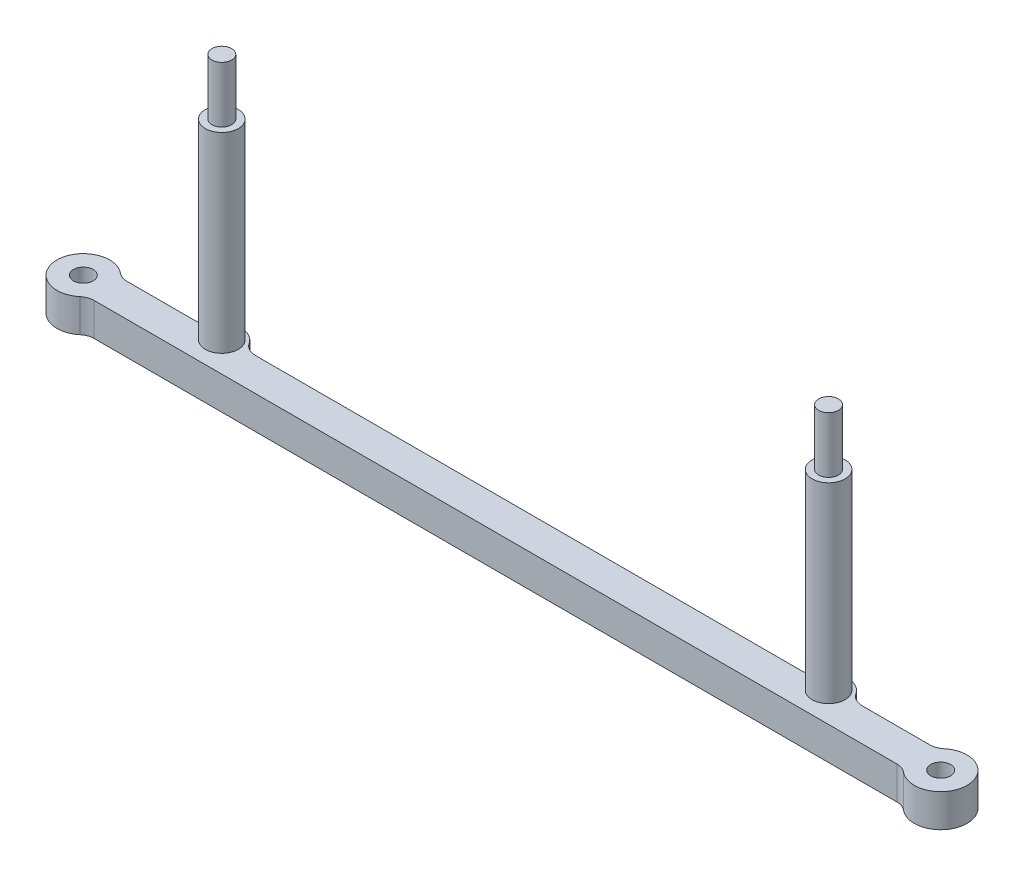
ISO-10303-21;
HEADER;
FILE_DESCRIPTION(('STEP AP214'),'2;1');
FILE_NAME('part.step','',(''),(''),'','','');
FILE_SCHEMA(('AUTOMOTIVE_DESIGN { 1 0 10303 214 1 1 1 1 }'));
ENDSEC;
DATA;
#1=APPLICATION_CONTEXT('core data for automotive mechanical design processes');
#2=APPLICATION_PROTOCOL_DEFINITION('international standard','automotive_design',2000,#1);
#3=PRODUCT_CONTEXT('',#1,'mechanical');
#4=PRODUCT('Part','Part','',(#3));
#5=PRODUCT_RELATED_PRODUCT_CATEGORY('part','',(#4));
#6=PRODUCT_DEFINITION_FORMATION('','',#4);
#7=PRODUCT_DEFINITION_CONTEXT('part definition',#1,'design');
#8=PRODUCT_DEFINITION('design','',#6,#7);
#9=PRODUCT_DEFINITION_SHAPE('','',#8);
#10=(LENGTH_UNIT() NAMED_UNIT(*) SI_UNIT(.MILLI.,.METRE.));
#11=(NAMED_UNIT(*) PLANE_ANGLE_UNIT() SI_UNIT($,.RADIAN.));
#12=(NAMED_UNIT(*) SI_UNIT($,.STERADIAN.) SOLID_ANGLE_UNIT());
#13=UNCERTAINTY_MEASURE_WITH_UNIT(LENGTH_MEASURE(1.E-05),#10,'distance_accuracy_value','');
#14=(GEOMETRIC_REPRESENTATION_CONTEXT(3) GLOBAL_UNCERTAINTY_ASSIGNED_CONTEXT((#13)) GLOBAL_UNIT_ASSIGNED_CONTEXT((#10,
#11,#12)) REPRESENTATION_CONTEXT('',''));
#15=CARTESIAN_POINT('',(0.,0.,0.));
#16=DIRECTION('',(0.,0.,1.));
#17=DIRECTION('',(1.,0.,0.));
#18=AXIS2_PLACEMENT_3D('',#15,#16,#17);
#19=CARTESIAN_POINT('',(46.,34.,-2.));
#20=DIRECTION('',(0.,1.,0.));
#21=DIRECTION('',(0.,0.,1.));
#22=AXIS2_PLACEMENT_3D('',#19,#20,#21);
#23=PLANE('',#22);
#24=CARTESIAN_POINT('',(46.,34.,-2.));
#25=DIRECTION('',(0.,1.,0.));
#26=DIRECTION('',(0.,0.,1.));
#27=AXIS2_PLACEMENT_3D('',#24,#25,#26);
#28=CIRCLE('',#27,2.5);
#29=CARTESIAN_POINT('',(46.,34.,0.500000000000002));
#30=VERTEX_POINT('',#29);
#31=EDGE_CURVE('E535',#30,#30,#28,.T.);
#32=ORIENTED_EDGE('',*,*,#31,.T.);
#33=EDGE_LOOP('',(#32));
#34=FACE_BOUND('',#33,.T.);
#35=CARTESIAN_POINT('',(46.,34.,-2.));
#36=DIRECTION('',(0.,1.,0.));
#37=DIRECTION('',(0.,0.,1.));
#38=AXIS2_PLACEMENT_3D('',#35,#36,#37);
#39=CIRCLE('',#38,1.5);
#40=CARTESIAN_POINT('',(46.,34.,-0.499999999999996));
#41=VERTEX_POINT('',#40);
#42=EDGE_CURVE('E524',#41,#41,#39,.T.);
#43=ORIENTED_EDGE('',*,*,#42,.F.);
#44=EDGE_LOOP('',(#43));
#45=FACE_BOUND('',#44,.T.);
#46=ADVANCED_FACE('F63',(#34,#45),#23,.T.);
#47=CARTESIAN_POINT('',(-46.,34.,-2.));
#48=DIRECTION('',(0.,1.,0.));
#49=DIRECTION('',(0.,0.,1.));
#50=AXIS2_PLACEMENT_3D('',#47,#48,#49);
#51=PLANE('',#50);
#52=CARTESIAN_POINT('',(-46.,34.,-2.));
#53=DIRECTION('',(0.,1.,0.));
#54=DIRECTION('',(0.,0.,1.));
#55=AXIS2_PLACEMENT_3D('',#52,#53,#54);
#56=CIRCLE('',#55,2.5);
#57=CARTESIAN_POINT('',(-46.,34.,0.500000000000002));
#58=VERTEX_POINT('',#57);
#59=EDGE_CURVE('E317',#58,#58,#56,.T.);
#60=ORIENTED_EDGE('',*,*,#59,.T.);
#61=EDGE_LOOP('',(#60));
#62=FACE_BOUND('',#61,.T.);
#63=CARTESIAN_POINT('',(-46.,34.,-2.));
#64=DIRECTION('',(0.,1.,0.));
#65=DIRECTION('',(0.,0.,1.));
#66=AXIS2_PLACEMENT_3D('',#63,#64,#65);
#67=CIRCLE('',#66,1.5);
#68=CARTESIAN_POINT('',(-46.,34.,-0.499999999999996));
#69=VERTEX_POINT('',#68);
#70=EDGE_CURVE('E523',#69,#69,#67,.T.);
#71=ORIENTED_EDGE('',*,*,#70,.F.);
#72=EDGE_LOOP('',(#71));
#73=FACE_BOUND('',#72,.T.);
#74=ADVANCED_FACE('F366',(#62,#73),#51,.T.);
#75=CARTESIAN_POINT('',(0.,5.,0.));
#76=DIRECTION('',(0.,1.,0.));
#77=DIRECTION('',(0.,0.,1.));
#78=AXIS2_PLACEMENT_3D('',#75,#76,#77);
#79=PLANE('',#78);
#80=CARTESIAN_POINT('',(-46.,5.,-2.));
#81=DIRECTION('',(0.,1.,0.));
#82=DIRECTION('',(0.,0.,1.));
#83=AXIS2_PLACEMENT_3D('',#80,#81,#82);
#84=CIRCLE('',#83,2.5);
#85=CARTESIAN_POINT('',(-46.,5.,0.500000000000002));
#86=VERTEX_POINT('',#85);
#87=EDGE_CURVE('E537',#86,#86,#84,.T.);
#88=ORIENTED_EDGE('',*,*,#87,.F.);
#89=EDGE_LOOP('',(#88));
#90=FACE_BOUND('',#89,.T.);
#91=DIRECTION('',(1.,0.,0.));
#92=VECTOR('',#91,1.);
#93=CARTESIAN_POINT('',(0.,5.,-2.5));
#94=LINE('',#93,#92);
#95=CARTESIAN_POINT('',(-41.3902277713536,5.,-2.5));
#96=VERTEX_POINT('',#95);
#97=CARTESIAN_POINT('',(41.3902277713536,5.,-2.5));
#98=VERTEX_POINT('',#97);
#99=EDGE_CURVE('E331',#96,#98,#94,.T.);
#100=ORIENTED_EDGE('',*,*,#99,.F.);
#101=CARTESIAN_POINT('',(-41.3902277713536,5.,-5.));
#102=DIRECTION('',(0.,1.,0.));
#103=DIRECTION('',(0.,0.,1.));
#104=AXIS2_PLACEMENT_3D('',#101,#102,#103);
#105=CIRCLE('',#104,2.5);
#106=CARTESIAN_POINT('',(-43.4855787843747,5.,-3.63636363636364));
#107=VERTEX_POINT('',#106);
#108=EDGE_CURVE('E187',#96,#107,#105,.F.);
#109=ORIENTED_EDGE('',*,*,#108,.T.);
#110=CARTESIAN_POINT('',(-46.,5.,-2.));
#111=DIRECTION('',(0.,1.,0.));
#112=DIRECTION('',(0.,0.,1.));
#113=AXIS2_PLACEMENT_3D('',#110,#111,#112);
#114=CIRCLE('',#113,3.);
#115=CARTESIAN_POINT('',(-48.5144212156253,5.,-3.63636363636364));
#116=VERTEX_POINT('',#115);
#117=EDGE_CURVE('E195',#107,#116,#114,.T.);
#118=ORIENTED_EDGE('',*,*,#117,.T.);
#119=CARTESIAN_POINT('',(-50.6097722286464,5.,-5.));
#120=DIRECTION('',(0.,1.,0.));
#121=DIRECTION('',(0.,0.,1.));
#122=AXIS2_PLACEMENT_3D('',#119,#120,#121);
#123=CIRCLE('',#122,2.5);
#124=CARTESIAN_POINT('',(-50.6097722286464,5.,-2.5));
#125=VERTEX_POINT('',#124);
#126=EDGE_CURVE('E78',#116,#125,#123,.F.);
#127=ORIENTED_EDGE('',*,*,#126,.T.);
#128=DIRECTION('',(1.,0.,0.));
#129=VECTOR('',#128,1.);
#130=CARTESIAN_POINT('',(0.,5.,-2.5));
#131=LINE('',#130,#129);
#132=CARTESIAN_POINT('',(-60.846688068541,5.,-2.5));
#133=VERTEX_POINT('',#132);
#134=EDGE_CURVE('E336',#133,#125,#131,.T.);
#135=ORIENTED_EDGE('',*,*,#134,.F.);
#136=CARTESIAN_POINT('',(-60.846688068541,5.,-5.));
#137=DIRECTION('',(0.,1.,0.));
#138=DIRECTION('',(0.,0.,1.));
#139=AXIS2_PLACEMENT_3D('',#136,#137,#138);
#140=CIRCLE('',#139,2.5);
#141=CARTESIAN_POINT('',(-62.4441157344867,5.,-3.07692307692308));
#142=VERTEX_POINT('',#141);
#143=EDGE_CURVE('E280',#133,#142,#140,.F.);
#144=ORIENTED_EDGE('',*,*,#143,.T.);
#145=CARTESIAN_POINT('',(-65.,5.,0.));
#146=DIRECTION('',(0.,1.,0.));
#147=DIRECTION('',(0.,0.,1.));
#148=AXIS2_PLACEMENT_3D('',#145,#146,#147);
#149=CIRCLE('',#148,4.00000000000001);
#150=CARTESIAN_POINT('',(-62.4441157344868,5.,3.07692307692309));
#151=VERTEX_POINT('',#150);
#152=EDGE_CURVE('E309',#142,#151,#149,.T.);
#153=ORIENTED_EDGE('',*,*,#152,.T.);
#154=CARTESIAN_POINT('',(-60.846688068541,5.,5.00000000000002));
#155=DIRECTION('',(0.,1.,0.));
#156=DIRECTION('',(0.,0.,1.));
#157=AXIS2_PLACEMENT_3D('',#154,#155,#156);
#158=CIRCLE('',#157,2.5);
#159=CARTESIAN_POINT('',(-60.846688068541,5.,2.50000000000002));
#160=VERTEX_POINT('',#159);
#161=EDGE_CURVE('E276',#151,#160,#158,.F.);
#162=ORIENTED_EDGE('',*,*,#161,.T.);
#163=DIRECTION('',(-1.,0.,0.));
#164=VECTOR('',#163,1.);
#165=CARTESIAN_POINT('',(0.,5.,2.50000000000002));
#166=LINE('',#165,#164);
#167=CARTESIAN_POINT('',(60.846688068541,5.,2.50000000000002));
#168=VERTEX_POINT('',#167);
#169=EDGE_CURVE('E301',#168,#160,#166,.T.);
#170=ORIENTED_EDGE('',*,*,#169,.F.);
#171=CARTESIAN_POINT('',(60.846688068541,5.,5.00000000000002));
#172=DIRECTION('',(0.,1.,0.));
#173=DIRECTION('',(0.,0.,1.));
#174=AXIS2_PLACEMENT_3D('',#171,#172,#173);
#175=CIRCLE('',#174,2.5);
#176=CARTESIAN_POINT('',(62.4441157344868,5.,3.07692307692309));
#177=VERTEX_POINT('',#176);
#178=EDGE_CURVE('E12',#168,#177,#175,.F.);
#179=ORIENTED_EDGE('',*,*,#178,.T.);
#180=CARTESIAN_POINT('',(65.,5.,0.));
#181=DIRECTION('',(0.,1.,0.));
#182=DIRECTION('',(0.,0.,1.));
#183=AXIS2_PLACEMENT_3D('',#180,#181,#182);
#184=CIRCLE('',#183,4.00000000000001);
#185=CARTESIAN_POINT('',(62.4441157344867,5.,-3.07692307692308));
#186=VERTEX_POINT('',#185);
#187=EDGE_CURVE('E299',#177,#186,#184,.T.);
#188=ORIENTED_EDGE('',*,*,#187,.T.);
#189=CARTESIAN_POINT('',(60.846688068541,5.,-5.));
#190=DIRECTION('',(0.,1.,0.));
#191=DIRECTION('',(0.,0.,1.));
#192=AXIS2_PLACEMENT_3D('',#189,#190,#191);
#193=CIRCLE('',#192,2.5);
#194=CARTESIAN_POINT('',(60.846688068541,5.,-2.5));
#195=VERTEX_POINT('',#194);
#196=EDGE_CURVE('E272',#186,#195,#193,.F.);
#197=ORIENTED_EDGE('',*,*,#196,.T.);
#198=DIRECTION('',(1.,0.,0.));
#199=VECTOR('',#198,1.);
#200=CARTESIAN_POINT('',(0.,5.,-2.5));
#201=LINE('',#200,#199);
#202=CARTESIAN_POINT('',(50.6097722286464,5.,-2.5));
#203=VERTEX_POINT('',#202);
#204=EDGE_CURVE('E226',#203,#195,#201,.T.);
#205=ORIENTED_EDGE('',*,*,#204,.F.);
#206=CARTESIAN_POINT('',(50.6097722286464,5.,-5.));
#207=DIRECTION('',(0.,1.,0.));
#208=DIRECTION('',(0.,0.,1.));
#209=AXIS2_PLACEMENT_3D('',#206,#207,#208);
#210=CIRCLE('',#209,2.5);
#211=CARTESIAN_POINT('',(48.5144212156253,5.,-3.63636363636364));
#212=VERTEX_POINT('',#211);
#213=EDGE_CURVE('E268',#203,#212,#210,.F.);
#214=ORIENTED_EDGE('',*,*,#213,.T.);
#215=CARTESIAN_POINT('',(46.,5.,-2.));
#216=DIRECTION('',(0.,1.,0.));
#217=DIRECTION('',(0.,0.,1.));
#218=AXIS2_PLACEMENT_3D('',#215,#216,#217);
#219=CIRCLE('',#218,3.);
#220=CARTESIAN_POINT('',(43.4855787843747,5.,-3.63636363636364));
#221=VERTEX_POINT('',#220);
#222=EDGE_CURVE('E332',#212,#221,#219,.T.);
#223=ORIENTED_EDGE('',*,*,#222,.T.);
#224=CARTESIAN_POINT('',(41.3902277713536,5.,-5.));
#225=DIRECTION('',(0.,1.,0.));
#226=DIRECTION('',(0.,0.,1.));
#227=AXIS2_PLACEMENT_3D('',#224,#225,#226);
#228=CIRCLE('',#227,2.5);
#229=EDGE_CURVE('E264',#221,#98,#228,.F.);
#230=ORIENTED_EDGE('',*,*,#229,.T.);
#231=EDGE_LOOP('',(#100,#109,#118,#127,#135,#144,#153,#162,#170,#179,#188,#197,#205,#214,#223,#230));
#232=FACE_BOUND('',#231,.T.);
#233=CARTESIAN_POINT('',(65.,5.,0.));
#234=DIRECTION('',(0.,1.,0.));
#235=DIRECTION('',(0.,0.,1.));
#236=AXIS2_PLACEMENT_3D('',#233,#234,#235);
#237=CIRCLE('',#236,1.5);
#238=CARTESIAN_POINT('',(65.,5.,1.5));
#239=VERTEX_POINT('',#238);
#240=EDGE_CURVE('E227',#239,#239,#237,.T.);
#241=ORIENTED_EDGE('',*,*,#240,.F.);
#242=EDGE_LOOP('',(#241));
#243=FACE_BOUND('',#242,.T.);
#244=CARTESIAN_POINT('',(-65.,5.,0.));
#245=DIRECTION('',(0.,1.,0.));
#246=DIRECTION('',(0.,0.,1.));
#247=AXIS2_PLACEMENT_3D('',#244,#245,#246);
#248=CIRCLE('',#247,1.5);
#249=CARTESIAN_POINT('',(-65.,5.,1.5));
#250=VERTEX_POINT('',#249);
#251=EDGE_CURVE('E305',#250,#250,#248,.T.);
#252=ORIENTED_EDGE('',*,*,#251,.F.);
#253=EDGE_LOOP('',(#252));
#254=FACE_BOUND('',#253,.T.);
#255=CARTESIAN_POINT('',(46.,5.,-2.));
#256=DIRECTION('',(0.,1.,0.));
#257=DIRECTION('',(0.,0.,1.));
#258=AXIS2_PLACEMENT_3D('',#255,#256,#257);
#259=CIRCLE('',#258,2.5);
#260=CARTESIAN_POINT('',(46.,5.,0.500000000000002));
#261=VERTEX_POINT('',#260);
#262=EDGE_CURVE('E533',#261,#261,#259,.T.);
#263=ORIENTED_EDGE('',*,*,#262,.F.);
#264=EDGE_LOOP('',(#263));
#265=FACE_BOUND('',#264,.T.);
#266=ADVANCED_FACE('F297',(#90,#232,#243,#254,#265),#79,.T.);
#267=CARTESIAN_POINT('',(0.,0.,0.));
#268=DIRECTION('',(0.,1.,0.));
#269=DIRECTION('',(0.,0.,1.));
#270=AXIS2_PLACEMENT_3D('',#267,#268,#269);
#271=PLANE('',#270);
#272=CARTESIAN_POINT('',(-46.,0.,-2.));
#273=DIRECTION('',(0.,1.,0.));
#274=DIRECTION('',(0.,0.,1.));
#275=AXIS2_PLACEMENT_3D('',#272,#273,#274);
#276=CIRCLE('',#275,3.);
#277=CARTESIAN_POINT('',(-43.4855787843747,0.,-3.63636363636364));
#278=VERTEX_POINT('',#277);
#279=CARTESIAN_POINT('',(-48.5144212156253,0.,-3.63636363636364));
#280=VERTEX_POINT('',#279);
#281=EDGE_CURVE('E193',#278,#280,#276,.T.);
#282=ORIENTED_EDGE('',*,*,#281,.F.);
#283=CARTESIAN_POINT('',(-41.3902277713536,0.,-5.));
#284=DIRECTION('',(0.,1.,0.));
#285=DIRECTION('',(0.,0.,1.));
#286=AXIS2_PLACEMENT_3D('',#283,#284,#285);
#287=CIRCLE('',#286,2.5);
#288=CARTESIAN_POINT('',(-41.3902277713536,0.,-2.5));
#289=VERTEX_POINT('',#288);
#290=EDGE_CURVE('E177',#278,#289,#287,.T.);
#291=ORIENTED_EDGE('',*,*,#290,.T.);
#292=DIRECTION('',(1.,0.,0.));
#293=VECTOR('',#292,1.);
#294=CARTESIAN_POINT('',(0.,0.,-2.5));
#295=LINE('',#294,#293);
#296=CARTESIAN_POINT('',(41.3902277713536,0.,-2.5));
#297=VERTEX_POINT('',#296);
#298=EDGE_CURVE('E204',#289,#297,#295,.T.);
#299=ORIENTED_EDGE('',*,*,#298,.T.);
#300=CARTESIAN_POINT('',(41.3902277713536,0.,-5.));
#301=DIRECTION('',(0.,1.,0.));
#302=DIRECTION('',(0.,0.,1.));
#303=AXIS2_PLACEMENT_3D('',#300,#301,#302);
#304=CIRCLE('',#303,2.5);
#305=CARTESIAN_POINT('',(43.4855787843747,0.,-3.63636363636364));
#306=VERTEX_POINT('',#305);
#307=EDGE_CURVE('E262',#297,#306,#304,.T.);
#308=ORIENTED_EDGE('',*,*,#307,.T.);
#309=CARTESIAN_POINT('',(46.,0.,-2.));
#310=DIRECTION('',(0.,1.,0.));
#311=DIRECTION('',(0.,0.,1.));
#312=AXIS2_PLACEMENT_3D('',#309,#310,#311);
#313=CIRCLE('',#312,3.);
#314=CARTESIAN_POINT('',(48.5144212156253,0.,-3.63636363636364));
#315=VERTEX_POINT('',#314);
#316=EDGE_CURVE('E208',#315,#306,#313,.T.);
#317=ORIENTED_EDGE('',*,*,#316,.F.);
#318=CARTESIAN_POINT('',(50.6097722286464,0.,-5.));
#319=DIRECTION('',(0.,1.,0.));
#320=DIRECTION('',(0.,0.,1.));
#321=AXIS2_PLACEMENT_3D('',#318,#319,#320);
#322=CIRCLE('',#321,2.5);
#323=CARTESIAN_POINT('',(50.6097722286464,0.,-2.5));
#324=VERTEX_POINT('',#323);
#325=EDGE_CURVE('E266',#315,#324,#322,.T.);
#326=ORIENTED_EDGE('',*,*,#325,.T.);
#327=DIRECTION('',(1.,0.,0.));
#328=VECTOR('',#327,1.);
#329=CARTESIAN_POINT('',(0.,0.,-2.5));
#330=LINE('',#329,#328);
#331=CARTESIAN_POINT('',(60.846688068541,0.,-2.5));
#332=VERTEX_POINT('',#331);
#333=EDGE_CURVE('E315',#324,#332,#330,.T.);
#334=ORIENTED_EDGE('',*,*,#333,.T.);
#335=CARTESIAN_POINT('',(60.846688068541,0.,-5.));
#336=DIRECTION('',(0.,1.,0.));
#337=DIRECTION('',(0.,0.,1.));
#338=AXIS2_PLACEMENT_3D('',#335,#336,#337);
#339=CIRCLE('',#338,2.5);
#340=CARTESIAN_POINT('',(62.4441157344867,0.,-3.07692307692308));
#341=VERTEX_POINT('',#340);
#342=EDGE_CURVE('E270',#332,#341,#339,.T.);
#343=ORIENTED_EDGE('',*,*,#342,.T.);
#344=CARTESIAN_POINT('',(65.,0.,0.));
#345=DIRECTION('',(0.,1.,0.));
#346=DIRECTION('',(0.,0.,1.));
#347=AXIS2_PLACEMENT_3D('',#344,#345,#346);
#348=CIRCLE('',#347,4.00000000000001);
#349=CARTESIAN_POINT('',(62.4441157344868,0.,3.07692307692309));
#350=VERTEX_POINT('',#349);
#351=EDGE_CURVE('E217',#350,#341,#348,.T.);
#352=ORIENTED_EDGE('',*,*,#351,.F.);
#353=CARTESIAN_POINT('',(60.846688068541,0.,5.00000000000002));
#354=DIRECTION('',(0.,1.,0.));
#355=DIRECTION('',(0.,0.,1.));
#356=AXIS2_PLACEMENT_3D('',#353,#354,#355);
#357=CIRCLE('',#356,2.5);
#358=CARTESIAN_POINT('',(60.846688068541,0.,2.50000000000002));
#359=VERTEX_POINT('',#358);
#360=EDGE_CURVE('E71',#350,#359,#357,.T.);
#361=ORIENTED_EDGE('',*,*,#360,.T.);
#362=DIRECTION('',(-1.,0.,0.));
#363=VECTOR('',#362,1.);
#364=CARTESIAN_POINT('',(0.,0.,2.50000000000002));
#365=LINE('',#364,#363);
#366=CARTESIAN_POINT('',(-60.846688068541,0.,2.50000000000002));
#367=VERTEX_POINT('',#366);
#368=EDGE_CURVE('E214',#359,#367,#365,.T.);
#369=ORIENTED_EDGE('',*,*,#368,.T.);
#370=CARTESIAN_POINT('',(-60.846688068541,0.,5.00000000000002));
#371=DIRECTION('',(0.,1.,0.));
#372=DIRECTION('',(0.,0.,1.));
#373=AXIS2_PLACEMENT_3D('',#370,#371,#372);
#374=CIRCLE('',#373,2.5);
#375=CARTESIAN_POINT('',(-62.4441157344868,0.,3.07692307692309));
#376=VERTEX_POINT('',#375);
#377=EDGE_CURVE('E274',#367,#376,#374,.T.);
#378=ORIENTED_EDGE('',*,*,#377,.T.);
#379=CARTESIAN_POINT('',(-65.,0.,0.));
#380=DIRECTION('',(0.,1.,0.));
#381=DIRECTION('',(0.,0.,1.));
#382=AXIS2_PLACEMENT_3D('',#379,#380,#381);
#383=CIRCLE('',#382,4.00000000000001);
#384=CARTESIAN_POINT('',(-62.4441157344867,0.,-3.07692307692308));
#385=VERTEX_POINT('',#384);
#386=EDGE_CURVE('E206',#385,#376,#383,.T.);
#387=ORIENTED_EDGE('',*,*,#386,.F.);
#388=CARTESIAN_POINT('',(-60.846688068541,0.,-5.));
#389=DIRECTION('',(0.,1.,0.));
#390=DIRECTION('',(0.,0.,1.));
#391=AXIS2_PLACEMENT_3D('',#388,#389,#390);
#392=CIRCLE('',#391,2.5);
#393=CARTESIAN_POINT('',(-60.846688068541,0.,-2.5));
#394=VERTEX_POINT('',#393);
#395=EDGE_CURVE('E278',#385,#394,#392,.T.);
#396=ORIENTED_EDGE('',*,*,#395,.T.);
#397=DIRECTION('',(1.,0.,0.));
#398=VECTOR('',#397,1.);
#399=CARTESIAN_POINT('',(0.,0.,-2.5));
#400=LINE('',#399,#398);
#401=CARTESIAN_POINT('',(-50.6097722286464,0.,-2.5));
#402=VERTEX_POINT('',#401);
#403=EDGE_CURVE('E203',#394,#402,#400,.T.);
#404=ORIENTED_EDGE('',*,*,#403,.T.);
#405=CARTESIAN_POINT('',(-50.6097722286464,0.,-5.));
#406=DIRECTION('',(0.,1.,0.));
#407=DIRECTION('',(0.,0.,1.));
#408=AXIS2_PLACEMENT_3D('',#405,#406,#407);
#409=CIRCLE('',#408,2.5);
#410=EDGE_CURVE('E202',#402,#280,#409,.T.);
#411=ORIENTED_EDGE('',*,*,#410,.T.);
#412=EDGE_LOOP('',(#282,#291,#299,#308,#317,#326,#334,#343,#352,#361,#369,#378,#387,#396,#404,#411));
#413=FACE_BOUND('',#412,.T.);
#414=CARTESIAN_POINT('',(65.,0.,0.));
#415=DIRECTION('',(0.,1.,0.));
#416=DIRECTION('',(0.,0.,1.));
#417=AXIS2_PLACEMENT_3D('',#414,#415,#416);
#418=CIRCLE('',#417,1.5);
#419=CARTESIAN_POINT('',(65.,0.,1.5));
#420=VERTEX_POINT('',#419);
#421=EDGE_CURVE('E223',#420,#420,#418,.T.);
#422=ORIENTED_EDGE('',*,*,#421,.T.);
#423=EDGE_LOOP('',(#422));
#424=FACE_BOUND('',#423,.T.);
#425=CARTESIAN_POINT('',(-65.,0.,0.));
#426=DIRECTION('',(0.,1.,0.));
#427=DIRECTION('',(0.,0.,1.));
#428=AXIS2_PLACEMENT_3D('',#425,#426,#427);
#429=CIRCLE('',#428,1.5);
#430=CARTESIAN_POINT('',(-65.,0.,1.5));
#431=VERTEX_POINT('',#430);
#432=EDGE_CURVE('E220',#431,#431,#429,.T.);
#433=ORIENTED_EDGE('',*,*,#432,.T.);
#434=EDGE_LOOP('',(#433));
#435=FACE_BOUND('',#434,.T.);
#436=ADVANCED_FACE('F199',(#413,#424,#435),#271,.F.);
#437=CARTESIAN_POINT('',(-46.,5.,-2.));
#438=DIRECTION('',(0.,-1.,0.));
#439=DIRECTION('',(0.,0.,-1.));
#440=AXIS2_PLACEMENT_3D('',#437,#438,#439);
#441=CYLINDRICAL_SURFACE('',#440,3.);
#442=ORIENTED_EDGE('',*,*,#117,.F.);
#443=DIRECTION('',(0.,-1.,0.));
#444=VECTOR('',#443,1.);
#445=CARTESIAN_POINT('',(-43.4855787843747,5.,-3.63636363636364));
#446=LINE('',#445,#444);
#447=EDGE_CURVE('E181',#107,#278,#446,.T.);
#448=ORIENTED_EDGE('',*,*,#447,.T.);
#449=ORIENTED_EDGE('',*,*,#281,.T.);
#450=DIRECTION('',(0.,-1.,0.));
#451=VECTOR('',#450,1.);
#452=CARTESIAN_POINT('',(-48.5144212156253,5.,-3.63636363636364));
#453=LINE('',#452,#451);
#454=EDGE_CURVE('E197',#280,#116,#453,.F.);
#455=ORIENTED_EDGE('',*,*,#454,.T.);
#456=EDGE_LOOP('',(#442,#448,#449,#455));
#457=FACE_BOUND('',#456,.T.);
#458=ADVANCED_FACE('F192',(#457),#441,.T.);
#459=CARTESIAN_POINT('',(0.,5.,-2.5));
#460=DIRECTION('',(0.,0.,-1.));
#461=DIRECTION('',(-1.,0.,0.));
#462=AXIS2_PLACEMENT_3D('',#459,#460,#461);
#463=PLANE('',#462);
#464=ORIENTED_EDGE('',*,*,#403,.F.);
#465=DIRECTION('',(0.,-1.,0.));
#466=VECTOR('',#465,1.);
#467=CARTESIAN_POINT('',(-60.846688068541,5.,-2.5));
#468=LINE('',#467,#466);
#469=EDGE_CURVE('E85',#394,#133,#468,.F.);
#470=ORIENTED_EDGE('',*,*,#469,.T.);
#471=ORIENTED_EDGE('',*,*,#134,.T.);
#472=DIRECTION('',(0.,-1.,0.));
#473=VECTOR('',#472,1.);
#474=CARTESIAN_POINT('',(-50.6097722286464,5.,-2.5));
#475=LINE('',#474,#473);
#476=EDGE_CURVE('E257',#125,#402,#475,.T.);
#477=ORIENTED_EDGE('',*,*,#476,.T.);
#478=EDGE_LOOP('',(#464,#470,#471,#477));
#479=FACE_BOUND('',#478,.T.);
#480=ADVANCED_FACE('F354',(#479),#463,.T.);
#481=CARTESIAN_POINT('',(-65.,5.,0.));
#482=DIRECTION('',(0.,-1.,0.));
#483=DIRECTION('',(0.,0.,-1.));
#484=AXIS2_PLACEMENT_3D('',#481,#482,#483);
#485=CYLINDRICAL_SURFACE('',#484,4.00000000000001);
#486=ORIENTED_EDGE('',*,*,#386,.T.);
#487=DIRECTION('',(0.,-1.,0.));
#488=VECTOR('',#487,1.);
#489=CARTESIAN_POINT('',(-62.4441157344868,5.,3.07692307692309));
#490=LINE('',#489,#488);
#491=EDGE_CURVE('E255',#376,#151,#490,.F.);
#492=ORIENTED_EDGE('',*,*,#491,.T.);
#493=ORIENTED_EDGE('',*,*,#152,.F.);
#494=DIRECTION('',(0.,-1.,0.));
#495=VECTOR('',#494,1.);
#496=CARTESIAN_POINT('',(-62.4441157344867,5.,-3.07692307692308));
#497=LINE('',#496,#495);
#498=EDGE_CURVE('E252',#142,#385,#497,.T.);
#499=ORIENTED_EDGE('',*,*,#498,.T.);
#500=EDGE_LOOP('',(#486,#492,#493,#499));
#501=FACE_BOUND('',#500,.T.);
#502=ADVANCED_FACE('F351',(#501),#485,.T.);
#503=CARTESIAN_POINT('',(0.,5.,2.50000000000002));
#504=DIRECTION('',(0.,0.,1.));
#505=DIRECTION('',(1.,0.,0.));
#506=AXIS2_PLACEMENT_3D('',#503,#504,#505);
#507=PLANE('',#506);
#508=ORIENTED_EDGE('',*,*,#169,.T.);
#509=DIRECTION('',(0.,-1.,0.));
#510=VECTOR('',#509,1.);
#511=CARTESIAN_POINT('',(-60.846688068541,5.,2.50000000000002));
#512=LINE('',#511,#510);
#513=EDGE_CURVE('E249',#160,#367,#512,.T.);
#514=ORIENTED_EDGE('',*,*,#513,.T.);
#515=ORIENTED_EDGE('',*,*,#368,.F.);
#516=DIRECTION('',(0.,-1.,0.));
#517=VECTOR('',#516,1.);
#518=CARTESIAN_POINT('',(60.846688068541,5.,2.50000000000002));
#519=LINE('',#518,#517);
#520=EDGE_CURVE('E247',#359,#168,#519,.F.);
#521=ORIENTED_EDGE('',*,*,#520,.T.);
#522=EDGE_LOOP('',(#508,#514,#515,#521));
#523=FACE_BOUND('',#522,.T.);
#524=ADVANCED_FACE('F290',(#523),#507,.T.);
#525=CARTESIAN_POINT('',(65.,5.,0.));
#526=DIRECTION('',(0.,-1.,0.));
#527=DIRECTION('',(0.,0.,-1.));
#528=AXIS2_PLACEMENT_3D('',#525,#526,#527);
#529=CYLINDRICAL_SURFACE('',#528,4.00000000000001);
#530=ORIENTED_EDGE('',*,*,#351,.T.);
#531=DIRECTION('',(0.,-1.,0.));
#532=VECTOR('',#531,1.);
#533=CARTESIAN_POINT('',(62.4441157344867,5.,-3.07692307692308));
#534=LINE('',#533,#532);
#535=EDGE_CURVE('E245',#341,#186,#534,.F.);
#536=ORIENTED_EDGE('',*,*,#535,.T.);
#537=ORIENTED_EDGE('',*,*,#187,.F.);
#538=DIRECTION('',(0.,-1.,0.));
#539=VECTOR('',#538,1.);
#540=CARTESIAN_POINT('',(62.4441157344868,5.,3.07692307692309));
#541=LINE('',#540,#539);
#542=EDGE_CURVE('E242',#177,#350,#541,.T.);
#543=ORIENTED_EDGE('',*,*,#542,.T.);
#544=EDGE_LOOP('',(#530,#536,#537,#543));
#545=FACE_BOUND('',#544,.T.);
#546=ADVANCED_FACE('F303',(#545),#529,.T.);
#547=CARTESIAN_POINT('',(0.,5.,-2.5));
#548=DIRECTION('',(0.,0.,-1.));
#549=DIRECTION('',(-1.,0.,0.));
#550=AXIS2_PLACEMENT_3D('',#547,#548,#549);
#551=PLANE('',#550);
#552=ORIENTED_EDGE('',*,*,#333,.F.);
#553=DIRECTION('',(0.,-1.,0.));
#554=VECTOR('',#553,1.);
#555=CARTESIAN_POINT('',(50.6097722286464,5.,-2.5));
#556=LINE('',#555,#554);
#557=EDGE_CURVE('E240',#324,#203,#556,.F.);
#558=ORIENTED_EDGE('',*,*,#557,.T.);
#559=ORIENTED_EDGE('',*,*,#204,.T.);
#560=DIRECTION('',(0.,-1.,0.));
#561=VECTOR('',#560,1.);
#562=CARTESIAN_POINT('',(60.846688068541,5.,-2.5));
#563=LINE('',#562,#561);
#564=EDGE_CURVE('E237',#195,#332,#563,.T.);
#565=ORIENTED_EDGE('',*,*,#564,.T.);
#566=EDGE_LOOP('',(#552,#558,#559,#565));
#567=FACE_BOUND('',#566,.T.);
#568=ADVANCED_FACE('F402',(#567),#551,.T.);
#569=CARTESIAN_POINT('',(46.,5.,-2.));
#570=DIRECTION('',(0.,-1.,0.));
#571=DIRECTION('',(0.,0.,-1.));
#572=AXIS2_PLACEMENT_3D('',#569,#570,#571);
#573=CYLINDRICAL_SURFACE('',#572,3.);
#574=ORIENTED_EDGE('',*,*,#316,.T.);
#575=DIRECTION('',(0.,-1.,0.));
#576=VECTOR('',#575,1.);
#577=CARTESIAN_POINT('',(43.4855787843747,5.,-3.63636363636364));
#578=LINE('',#577,#576);
#579=EDGE_CURVE('E235',#306,#221,#578,.F.);
#580=ORIENTED_EDGE('',*,*,#579,.T.);
#581=ORIENTED_EDGE('',*,*,#222,.F.);
#582=DIRECTION('',(0.,-1.,0.));
#583=VECTOR('',#582,1.);
#584=CARTESIAN_POINT('',(48.5144212156253,5.,-3.63636363636364));
#585=LINE('',#584,#583);
#586=EDGE_CURVE('E232',#212,#315,#585,.T.);
#587=ORIENTED_EDGE('',*,*,#586,.T.);
#588=EDGE_LOOP('',(#574,#580,#581,#587));
#589=FACE_BOUND('',#588,.T.);
#590=ADVANCED_FACE('F322',(#589),#573,.T.);
#591=CARTESIAN_POINT('',(0.,5.,-2.5));
#592=DIRECTION('',(0.,0.,-1.));
#593=DIRECTION('',(-1.,0.,0.));
#594=AXIS2_PLACEMENT_3D('',#591,#592,#593);
#595=PLANE('',#594);
#596=ORIENTED_EDGE('',*,*,#298,.F.);
#597=DIRECTION('',(0.,-1.,0.));
#598=VECTOR('',#597,1.);
#599=CARTESIAN_POINT('',(-41.3902277713536,5.,-2.5));
#600=LINE('',#599,#598);
#601=EDGE_CURVE('E182',#289,#96,#600,.F.);
#602=ORIENTED_EDGE('',*,*,#601,.T.);
#603=ORIENTED_EDGE('',*,*,#99,.T.);
#604=DIRECTION('',(0.,-1.,0.));
#605=VECTOR('',#604,1.);
#606=CARTESIAN_POINT('',(41.3902277713536,5.,-2.5));
#607=LINE('',#606,#605);
#608=EDGE_CURVE('E196',#98,#297,#607,.T.);
#609=ORIENTED_EDGE('',*,*,#608,.T.);
#610=EDGE_LOOP('',(#596,#602,#603,#609));
#611=FACE_BOUND('',#610,.T.);
#612=ADVANCED_FACE('F334',(#611),#595,.T.);
#613=CARTESIAN_POINT('',(-65.,5.,0.));
#614=DIRECTION('',(0.,-1.,0.));
#615=DIRECTION('',(0.,0.,-1.));
#616=AXIS2_PLACEMENT_3D('',#613,#614,#615);
#617=CYLINDRICAL_SURFACE('',#616,1.5);
#618=ORIENTED_EDGE('',*,*,#251,.T.);
#619=EDGE_LOOP('',(#618));
#620=FACE_BOUND('',#619,.T.);
#621=ORIENTED_EDGE('',*,*,#432,.F.);
#622=EDGE_LOOP('',(#621));
#623=FACE_BOUND('',#622,.T.);
#624=ADVANCED_FACE('F395',(#620,#623),#617,.F.);
#625=CARTESIAN_POINT('',(65.,5.,0.));
#626=DIRECTION('',(0.,-1.,0.));
#627=DIRECTION('',(0.,0.,-1.));
#628=AXIS2_PLACEMENT_3D('',#625,#626,#627);
#629=CYLINDRICAL_SURFACE('',#628,1.5);
#630=ORIENTED_EDGE('',*,*,#240,.T.);
#631=EDGE_LOOP('',(#630));
#632=FACE_BOUND('',#631,.T.);
#633=ORIENTED_EDGE('',*,*,#421,.F.);
#634=EDGE_LOOP('',(#633));
#635=FACE_BOUND('',#634,.T.);
#636=ADVANCED_FACE('F392',(#632,#635),#629,.F.);
#637=CARTESIAN_POINT('',(-41.3902277713536,5.,-5.));
#638=DIRECTION('',(0.,-1.,0.));
#639=DIRECTION('',(0.,0.,-1.));
#640=AXIS2_PLACEMENT_3D('',#637,#638,#639);
#641=CYLINDRICAL_SURFACE('',#640,2.5);
#642=ORIENTED_EDGE('',*,*,#108,.F.);
#643=ORIENTED_EDGE('',*,*,#601,.F.);
#644=ORIENTED_EDGE('',*,*,#290,.F.);
#645=ORIENTED_EDGE('',*,*,#447,.F.);
#646=EDGE_LOOP('',(#642,#643,#644,#645));
#647=FACE_BOUND('',#646,.T.);
#648=ADVANCED_FACE('F180',(#647),#641,.F.);
#649=CARTESIAN_POINT('',(41.3902277713536,5.,-5.));
#650=DIRECTION('',(0.,-1.,0.));
#651=DIRECTION('',(0.,0.,-1.));
#652=AXIS2_PLACEMENT_3D('',#649,#650,#651);
#653=CYLINDRICAL_SURFACE('',#652,2.5);
#654=ORIENTED_EDGE('',*,*,#229,.F.);
#655=ORIENTED_EDGE('',*,*,#579,.F.);
#656=ORIENTED_EDGE('',*,*,#307,.F.);
#657=ORIENTED_EDGE('',*,*,#608,.F.);
#658=EDGE_LOOP('',(#654,#655,#656,#657));
#659=FACE_BOUND('',#658,.T.);
#660=ADVANCED_FACE('F328',(#659),#653,.F.);
#661=CARTESIAN_POINT('',(50.6097722286464,5.,-5.));
#662=DIRECTION('',(0.,-1.,0.));
#663=DIRECTION('',(0.,0.,-1.));
#664=AXIS2_PLACEMENT_3D('',#661,#662,#663);
#665=CYLINDRICAL_SURFACE('',#664,2.5);
#666=ORIENTED_EDGE('',*,*,#213,.F.);
#667=ORIENTED_EDGE('',*,*,#557,.F.);
#668=ORIENTED_EDGE('',*,*,#325,.F.);
#669=ORIENTED_EDGE('',*,*,#586,.F.);
#670=EDGE_LOOP('',(#666,#667,#668,#669));
#671=FACE_BOUND('',#670,.T.);
#672=ADVANCED_FACE('F422',(#671),#665,.F.);
#673=CARTESIAN_POINT('',(60.846688068541,5.,-5.));
#674=DIRECTION('',(0.,-1.,0.));
#675=DIRECTION('',(0.,0.,-1.));
#676=AXIS2_PLACEMENT_3D('',#673,#674,#675);
#677=CYLINDRICAL_SURFACE('',#676,2.5);
#678=ORIENTED_EDGE('',*,*,#196,.F.);
#679=ORIENTED_EDGE('',*,*,#535,.F.);
#680=ORIENTED_EDGE('',*,*,#342,.F.);
#681=ORIENTED_EDGE('',*,*,#564,.F.);
#682=EDGE_LOOP('',(#678,#679,#680,#681));
#683=FACE_BOUND('',#682,.T.);
#684=ADVANCED_FACE('F425',(#683),#677,.F.);
#685=CARTESIAN_POINT('',(-60.846688068541,5.,5.00000000000002));
#686=DIRECTION('',(0.,-1.,0.));
#687=DIRECTION('',(0.,0.,-1.));
#688=AXIS2_PLACEMENT_3D('',#685,#686,#687);
#689=CYLINDRICAL_SURFACE('',#688,2.5);
#690=ORIENTED_EDGE('',*,*,#161,.F.);
#691=ORIENTED_EDGE('',*,*,#491,.F.);
#692=ORIENTED_EDGE('',*,*,#377,.F.);
#693=ORIENTED_EDGE('',*,*,#513,.F.);
#694=EDGE_LOOP('',(#690,#691,#692,#693));
#695=FACE_BOUND('',#694,.T.);
#696=ADVANCED_FACE('F349',(#695),#689,.F.);
#697=CARTESIAN_POINT('',(-60.846688068541,5.,-5.));
#698=DIRECTION('',(0.,-1.,0.));
#699=DIRECTION('',(0.,0.,-1.));
#700=AXIS2_PLACEMENT_3D('',#697,#698,#699);
#701=CYLINDRICAL_SURFACE('',#700,2.5);
#702=ORIENTED_EDGE('',*,*,#143,.F.);
#703=ORIENTED_EDGE('',*,*,#469,.F.);
#704=ORIENTED_EDGE('',*,*,#395,.F.);
#705=ORIENTED_EDGE('',*,*,#498,.F.);
#706=EDGE_LOOP('',(#702,#703,#704,#705));
#707=FACE_BOUND('',#706,.T.);
#708=ADVANCED_FACE('F353',(#707),#701,.F.);
#709=CARTESIAN_POINT('',(-50.6097722286464,5.,-5.));
#710=DIRECTION('',(0.,-1.,0.));
#711=DIRECTION('',(0.,0.,-1.));
#712=AXIS2_PLACEMENT_3D('',#709,#710,#711);
#713=CYLINDRICAL_SURFACE('',#712,2.5);
#714=ORIENTED_EDGE('',*,*,#126,.F.);
#715=ORIENTED_EDGE('',*,*,#454,.F.);
#716=ORIENTED_EDGE('',*,*,#410,.F.);
#717=ORIENTED_EDGE('',*,*,#476,.F.);
#718=EDGE_LOOP('',(#714,#715,#716,#717));
#719=FACE_BOUND('',#718,.T.);
#720=ADVANCED_FACE('F357',(#719),#713,.F.);
#721=CARTESIAN_POINT('',(60.846688068541,5.,5.00000000000002));
#722=DIRECTION('',(0.,-1.,0.));
#723=DIRECTION('',(0.,0.,-1.));
#724=AXIS2_PLACEMENT_3D('',#721,#722,#723);
#725=CYLINDRICAL_SURFACE('',#724,2.5);
#726=ORIENTED_EDGE('',*,*,#178,.F.);
#727=ORIENTED_EDGE('',*,*,#520,.F.);
#728=ORIENTED_EDGE('',*,*,#360,.F.);
#729=ORIENTED_EDGE('',*,*,#542,.F.);
#730=EDGE_LOOP('',(#726,#727,#728,#729));
#731=FACE_BOUND('',#730,.T.);
#732=ADVANCED_FACE('F65',(#731),#725,.F.);
#733=CARTESIAN_POINT('',(-46.,34.,-2.));
#734=DIRECTION('',(0.,-1.,0.));
#735=DIRECTION('',(0.,0.,-1.));
#736=AXIS2_PLACEMENT_3D('',#733,#734,#735);
#737=CYLINDRICAL_SURFACE('',#736,2.5);
#738=ORIENTED_EDGE('',*,*,#59,.F.);
#739=EDGE_LOOP('',(#738));
#740=FACE_BOUND('',#739,.T.);
#741=ORIENTED_EDGE('',*,*,#87,.T.);
#742=EDGE_LOOP('',(#741));
#743=FACE_BOUND('',#742,.T.);
#744=ADVANCED_FACE('F363',(#740,#743),#737,.T.);
#745=CARTESIAN_POINT('',(46.,34.,-2.));
#746=DIRECTION('',(0.,-1.,0.));
#747=DIRECTION('',(0.,0.,-1.));
#748=AXIS2_PLACEMENT_3D('',#745,#746,#747);
#749=CYLINDRICAL_SURFACE('',#748,2.5);
#750=ORIENTED_EDGE('',*,*,#31,.F.);
#751=EDGE_LOOP('',(#750));
#752=FACE_BOUND('',#751,.T.);
#753=ORIENTED_EDGE('',*,*,#262,.T.);
#754=EDGE_LOOP('',(#753));
#755=FACE_BOUND('',#754,.T.);
#756=ADVANCED_FACE('F380',(#752,#755),#749,.T.);
#757=CARTESIAN_POINT('',(-46.,42.5,-2.));
#758=DIRECTION('',(0.,-1.,0.));
#759=DIRECTION('',(0.,0.,-1.));
#760=AXIS2_PLACEMENT_3D('',#757,#758,#759);
#761=CYLINDRICAL_SURFACE('',#760,1.5);
#762=CARTESIAN_POINT('',(-46.,42.5,-2.));
#763=DIRECTION('',(0.,1.,0.));
#764=DIRECTION('',(0.,0.,1.));
#765=AXIS2_PLACEMENT_3D('',#762,#763,#764);
#766=CIRCLE('',#765,1.5);
#767=CARTESIAN_POINT('',(-46.,42.5,-0.499999999999996));
#768=VERTEX_POINT('',#767);
#769=EDGE_CURVE('E527',#768,#768,#766,.T.);
#770=ORIENTED_EDGE('',*,*,#769,.F.);
#771=EDGE_LOOP('',(#770));
#772=FACE_BOUND('',#771,.T.);
#773=ORIENTED_EDGE('',*,*,#70,.T.);
#774=EDGE_LOOP('',(#773));
#775=FACE_BOUND('',#774,.T.);
#776=ADVANCED_FACE('F378',(#772,#775),#761,.T.);
#777=CARTESIAN_POINT('',(-46.,42.5,-2.));
#778=DIRECTION('',(0.,1.,0.));
#779=DIRECTION('',(0.,0.,1.));
#780=AXIS2_PLACEMENT_3D('',#777,#778,#779);
#781=PLANE('',#780);
#782=ORIENTED_EDGE('',*,*,#769,.T.);
#783=EDGE_LOOP('',(#782));
#784=FACE_BOUND('',#783,.T.);
#785=ADVANCED_FACE('F488',(#784),#781,.T.);
#786=CARTESIAN_POINT('',(46.,42.5,-2.));
#787=DIRECTION('',(0.,-1.,0.));
#788=DIRECTION('',(0.,0.,-1.));
#789=AXIS2_PLACEMENT_3D('',#786,#787,#788);
#790=CYLINDRICAL_SURFACE('',#789,1.5);
#791=CARTESIAN_POINT('',(46.,42.5,-2.));
#792=DIRECTION('',(0.,1.,0.));
#793=DIRECTION('',(0.,0.,1.));
#794=AXIS2_PLACEMENT_3D('',#791,#792,#793);
#795=CIRCLE('',#794,1.5);
#796=CARTESIAN_POINT('',(46.,42.5,-0.499999999999996));
#797=VERTEX_POINT('',#796);
#798=EDGE_CURVE('E522',#797,#797,#795,.T.);
#799=ORIENTED_EDGE('',*,*,#798,.F.);
#800=EDGE_LOOP('',(#799));
#801=FACE_BOUND('',#800,.T.);
#802=ORIENTED_EDGE('',*,*,#42,.T.);
#803=EDGE_LOOP('',(#802));
#804=FACE_BOUND('',#803,.T.);
#805=ADVANCED_FACE('F497',(#801,#804),#790,.T.);
#806=CARTESIAN_POINT('',(46.,42.5,-2.));
#807=DIRECTION('',(0.,1.,0.));
#808=DIRECTION('',(0.,0.,1.));
#809=AXIS2_PLACEMENT_3D('',#806,#807,#808);
#810=PLANE('',#809);
#811=ORIENTED_EDGE('',*,*,#798,.T.);
#812=EDGE_LOOP('',(#811));
#813=FACE_BOUND('',#812,.T.);
#814=ADVANCED_FACE('F506',(#813),#810,.T.);
#815=CLOSED_SHELL('',(#46,#74,#266,#436,#458,#480,#502,#524,#546,#568,#590,#612,#624,#636,#648,
#660,#672,#684,#696,#708,#720,#732,#744,#756,#776,#785,#805,#814));
#816=MANIFOLD_SOLID_BREP('B2',#815);
#817=ADVANCED_BREP_SHAPE_REPRESENTATION('',(#18,#816),#14);
#818=SHAPE_DEFINITION_REPRESENTATION(#9,#817);
ENDSEC;
END-ISO-10303-21;
